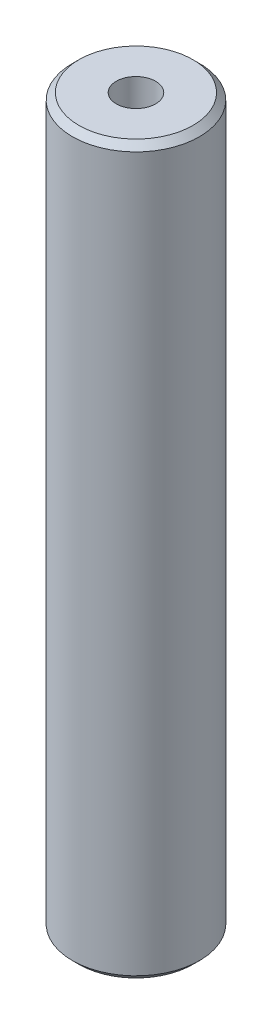
ISO-10303-21;
HEADER;
FILE_DESCRIPTION(('STEP AP214'),'2;1');
FILE_NAME('part.step','',(''),(''),'','','');
FILE_SCHEMA(('AUTOMOTIVE_DESIGN { 1 0 10303 214 1 1 1 1 }'));
ENDSEC;
DATA;
#1=APPLICATION_CONTEXT('core data for automotive mechanical design processes');
#2=APPLICATION_PROTOCOL_DEFINITION('international standard','automotive_design',2000,#1);
#3=PRODUCT_CONTEXT('',#1,'mechanical');
#4=PRODUCT('Part','Part','',(#3));
#5=PRODUCT_RELATED_PRODUCT_CATEGORY('part','',(#4));
#6=PRODUCT_DEFINITION_FORMATION('','',#4);
#7=PRODUCT_DEFINITION_CONTEXT('part definition',#1,'design');
#8=PRODUCT_DEFINITION('design','',#6,#7);
#9=PRODUCT_DEFINITION_SHAPE('','',#8);
#10=(LENGTH_UNIT() NAMED_UNIT(*) SI_UNIT(.MILLI.,.METRE.));
#11=(NAMED_UNIT(*) PLANE_ANGLE_UNIT() SI_UNIT($,.RADIAN.));
#12=(NAMED_UNIT(*) SI_UNIT($,.STERADIAN.) SOLID_ANGLE_UNIT());
#13=UNCERTAINTY_MEASURE_WITH_UNIT(LENGTH_MEASURE(1.E-05),#10,'distance_accuracy_value','');
#14=(GEOMETRIC_REPRESENTATION_CONTEXT(3) GLOBAL_UNCERTAINTY_ASSIGNED_CONTEXT((#13)) GLOBAL_UNIT_ASSIGNED_CONTEXT((#10,
#11,#12)) REPRESENTATION_CONTEXT('',''));
#15=CARTESIAN_POINT('',(0.,0.,0.));
#16=DIRECTION('',(0.,0.,1.));
#17=DIRECTION('',(1.,0.,0.));
#18=AXIS2_PLACEMENT_3D('',#15,#16,#17);
#19=CARTESIAN_POINT('',(0.,285.929413298133,0.));
#20=DIRECTION('',(0.,-1.,0.));
#21=DIRECTION('',(0.,0.,-1.));
#22=AXIS2_PLACEMENT_3D('',#19,#20,#21);
#23=CYLINDRICAL_SURFACE('',#22,25.);
#24=CARTESIAN_POINT('',(0.,283.368369809305,0.));
#25=DIRECTION('',(0.,1.,0.));
#26=DIRECTION('',(0.,0.,1.));
#27=AXIS2_PLACEMENT_3D('',#24,#25,#26);
#28=CIRCLE('',#27,25.);
#29=CARTESIAN_POINT('',(0.,283.368369809305,25.));
#30=VERTEX_POINT('',#29);
#31=EDGE_CURVE('E50',#30,#30,#28,.F.);
#32=ORIENTED_EDGE('',*,*,#31,.T.);
#33=EDGE_LOOP('',(#32));
#34=FACE_BOUND('',#33,.T.);
#35=CARTESIAN_POINT('',(0.,2.56104348882774,0.));
#36=DIRECTION('',(0.,1.,0.));
#37=DIRECTION('',(0.,0.,1.));
#38=AXIS2_PLACEMENT_3D('',#35,#36,#37);
#39=CIRCLE('',#38,25.);
#40=CARTESIAN_POINT('',(0.,2.56104348882774,25.));
#41=VERTEX_POINT('',#40);
#42=EDGE_CURVE('E51',#41,#41,#39,.T.);
#43=ORIENTED_EDGE('',*,*,#42,.T.);
#44=EDGE_LOOP('',(#43));
#45=FACE_BOUND('',#44,.T.);
#46=ADVANCED_FACE('F39',(#34,#45),#23,.T.);
#47=CARTESIAN_POINT('',(0.,285.929413298133,0.));
#48=DIRECTION('',(0.,1.,0.));
#49=DIRECTION('',(0.,0.,1.));
#50=AXIS2_PLACEMENT_3D('',#47,#48,#49);
#51=PLANE('',#50);
#52=CARTESIAN_POINT('',(0.,285.929413298133,0.));
#53=DIRECTION('',(0.,1.,0.));
#54=DIRECTION('',(0.,0.,1.));
#55=AXIS2_PLACEMENT_3D('',#52,#53,#54);
#56=CIRCLE('',#55,22.4389565111723);
#57=CARTESIAN_POINT('',(0.,285.929413298133,22.4389565111723));
#58=VERTEX_POINT('',#57);
#59=EDGE_CURVE('E54',#58,#58,#56,.T.);
#60=ORIENTED_EDGE('',*,*,#59,.T.);
#61=EDGE_LOOP('',(#60));
#62=FACE_BOUND('',#61,.T.);
#63=CARTESIAN_POINT('',(0.,285.929413298133,0.));
#64=DIRECTION('',(0.,1.,0.));
#65=DIRECTION('',(0.,0.,1.));
#66=AXIS2_PLACEMENT_3D('',#63,#64,#65);
#67=CIRCLE('',#66,7.7367212950665);
#68=CARTESIAN_POINT('',(0.,285.929413298133,7.7367212950665));
#69=VERTEX_POINT('',#68);
#70=EDGE_CURVE('E58',#69,#69,#67,.T.);
#71=ORIENTED_EDGE('',*,*,#70,.F.);
#72=EDGE_LOOP('',(#71));
#73=FACE_BOUND('',#72,.T.);
#74=ADVANCED_FACE('F69',(#62,#73),#51,.T.);
#75=CARTESIAN_POINT('',(0.,0.,0.));
#76=DIRECTION('',(0.,1.,0.));
#77=DIRECTION('',(0.,0.,1.));
#78=AXIS2_PLACEMENT_3D('',#75,#76,#77);
#79=PLANE('',#78);
#80=CARTESIAN_POINT('',(0.,0.,0.));
#81=DIRECTION('',(0.,1.,0.));
#82=DIRECTION('',(0.,0.,1.));
#83=AXIS2_PLACEMENT_3D('',#80,#81,#82);
#84=CIRCLE('',#83,22.4389565111723);
#85=CARTESIAN_POINT('',(0.,0.,22.4389565111723));
#86=VERTEX_POINT('',#85);
#87=EDGE_CURVE('E10',#86,#86,#84,.F.);
#88=ORIENTED_EDGE('',*,*,#87,.T.);
#89=EDGE_LOOP('',(#88));
#90=FACE_BOUND('',#89,.T.);
#91=CARTESIAN_POINT('',(0.,0.,0.));
#92=DIRECTION('',(0.,1.,0.));
#93=DIRECTION('',(0.,0.,1.));
#94=AXIS2_PLACEMENT_3D('',#91,#92,#93);
#95=CIRCLE('',#94,7.7367212950665);
#96=CARTESIAN_POINT('',(0.,0.,7.7367212950665));
#97=VERTEX_POINT('',#96);
#98=EDGE_CURVE('E63',#97,#97,#95,.T.);
#99=ORIENTED_EDGE('',*,*,#98,.T.);
#100=EDGE_LOOP('',(#99));
#101=FACE_BOUND('',#100,.T.);
#102=ADVANCED_FACE('F75',(#90,#101),#79,.F.);
#103=CARTESIAN_POINT('',(0.,285.929413298133,0.));
#104=DIRECTION('',(0.,-1.,0.));
#105=DIRECTION('',(0.,0.,-1.));
#106=AXIS2_PLACEMENT_3D('',#103,#104,#105);
#107=CYLINDRICAL_SURFACE('',#106,7.7367212950665);
#108=ORIENTED_EDGE('',*,*,#70,.T.);
#109=EDGE_LOOP('',(#108));
#110=FACE_BOUND('',#109,.T.);
#111=ORIENTED_EDGE('',*,*,#98,.F.);
#112=EDGE_LOOP('',(#111));
#113=FACE_BOUND('',#112,.T.);
#114=ADVANCED_FACE('F70',(#110,#113),#107,.F.);
#115=CARTESIAN_POINT('',(0.,285.929413298133,0.));
#116=DIRECTION('',(0.,-1.,0.));
#117=DIRECTION('',(0.,0.,-1.));
#118=AXIS2_PLACEMENT_3D('',#115,#116,#117);
#119=CONICAL_SURFACE('',#118,22.4389565111723,0.785398163397439);
#120=ORIENTED_EDGE('',*,*,#31,.F.);
#121=EDGE_LOOP('',(#120));
#122=FACE_BOUND('',#121,.T.);
#123=ORIENTED_EDGE('',*,*,#59,.F.);
#124=EDGE_LOOP('',(#123));
#125=FACE_BOUND('',#124,.T.);
#126=ADVANCED_FACE('F81',(#122,#125),#119,.T.);
#127=CARTESIAN_POINT('',(0.,2.56104348882774,0.));
#128=DIRECTION('',(0.,1.,0.));
#129=DIRECTION('',(0.,0.,1.));
#130=AXIS2_PLACEMENT_3D('',#127,#128,#129);
#131=CONICAL_SURFACE('',#130,25.,0.785398163397444);
#132=ORIENTED_EDGE('',*,*,#87,.F.);
#133=EDGE_LOOP('',(#132));
#134=FACE_BOUND('',#133,.T.);
#135=ORIENTED_EDGE('',*,*,#42,.F.);
#136=EDGE_LOOP('',(#135));
#137=FACE_BOUND('',#136,.T.);
#138=ADVANCED_FACE('F45',(#134,#137),#131,.T.);
#139=CLOSED_SHELL('',(#46,#74,#102,#114,#126,#138));
#140=MANIFOLD_SOLID_BREP('B2',#139);
#141=ADVANCED_BREP_SHAPE_REPRESENTATION('',(#18,#140),#14);
#142=SHAPE_DEFINITION_REPRESENTATION(#9,#141);
ENDSEC;
END-ISO-10303-21;
